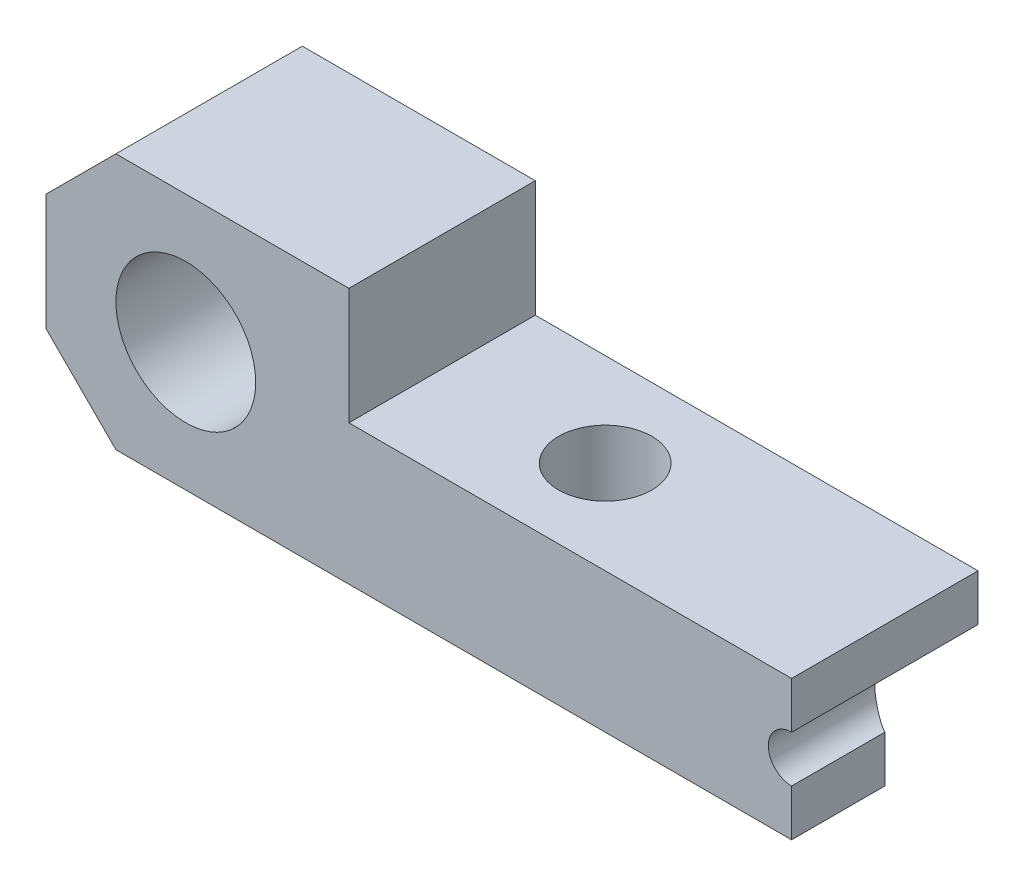
ISO-10303-21;
HEADER;
FILE_DESCRIPTION(('STEP AP214'),'2;1');
FILE_NAME('part.step','',(''),(''),'','','');
FILE_SCHEMA(('AUTOMOTIVE_DESIGN { 1 0 10303 214 1 1 1 1 }'));
ENDSEC;
DATA;
#1=APPLICATION_CONTEXT('core data for automotive mechanical design processes');
#2=APPLICATION_PROTOCOL_DEFINITION('international standard','automotive_design',2000,#1);
#3=PRODUCT_CONTEXT('',#1,'mechanical');
#4=PRODUCT('Part','Part','',(#3));
#5=PRODUCT_RELATED_PRODUCT_CATEGORY('part','',(#4));
#6=PRODUCT_DEFINITION_FORMATION('','',#4);
#7=PRODUCT_DEFINITION_CONTEXT('part definition',#1,'design');
#8=PRODUCT_DEFINITION('design','',#6,#7);
#9=PRODUCT_DEFINITION_SHAPE('','',#8);
#10=(LENGTH_UNIT() NAMED_UNIT(*) SI_UNIT(.MILLI.,.METRE.));
#11=(NAMED_UNIT(*) PLANE_ANGLE_UNIT() SI_UNIT($,.RADIAN.));
#12=(NAMED_UNIT(*) SI_UNIT($,.STERADIAN.) SOLID_ANGLE_UNIT());
#13=UNCERTAINTY_MEASURE_WITH_UNIT(LENGTH_MEASURE(1.E-05),#10,'distance_accuracy_value','');
#14=(GEOMETRIC_REPRESENTATION_CONTEXT(3) GLOBAL_UNCERTAINTY_ASSIGNED_CONTEXT((#13)) GLOBAL_UNIT_ASSIGNED_CONTEXT((#10,
#11,#12)) REPRESENTATION_CONTEXT('',''));
#15=CARTESIAN_POINT('',(0.,0.,0.));
#16=DIRECTION('',(0.,0.,1.));
#17=DIRECTION('',(1.,0.,0.));
#18=AXIS2_PLACEMENT_3D('',#15,#16,#17);
#19=CARTESIAN_POINT('',(32.,0.,8.));
#20=DIRECTION('',(-1.,0.,0.));
#21=DIRECTION('',(0.,0.,1.));
#22=AXIS2_PLACEMENT_3D('',#19,#20,#21);
#23=PLANE('',#22);
#24=DIRECTION('',(0.,0.,-1.));
#25=VECTOR('',#24,1.);
#26=CARTESIAN_POINT('',(32.,0.,8.));
#27=LINE('',#26,#25);
#28=CARTESIAN_POINT('',(32.,0.,8.));
#29=VERTEX_POINT('',#28);
#30=CARTESIAN_POINT('',(32.,0.,4.));
#31=VERTEX_POINT('',#30);
#32=EDGE_CURVE('E156',#29,#31,#27,.T.);
#33=ORIENTED_EDGE('',*,*,#32,.T.);
#34=DIRECTION('',(0.,-1.,0.));
#35=VECTOR('',#34,1.);
#36=CARTESIAN_POINT('',(32.,4.,4.));
#37=LINE('',#36,#35);
#38=CARTESIAN_POINT('',(32.,2.,4.));
#39=VERTEX_POINT('',#38);
#40=EDGE_CURVE('E141',#39,#31,#37,.T.);
#41=ORIENTED_EDGE('',*,*,#40,.F.);
#42=DIRECTION('',(0.,0.,1.));
#43=VECTOR('',#42,1.);
#44=CARTESIAN_POINT('',(32.,2.,0.));
#45=LINE('',#44,#43);
#46=CARTESIAN_POINT('',(32.,2.,8.));
#47=VERTEX_POINT('',#46);
#48=EDGE_CURVE('E149',#39,#47,#45,.T.);
#49=ORIENTED_EDGE('',*,*,#48,.T.);
#50=DIRECTION('',(0.,1.,0.));
#51=VECTOR('',#50,1.);
#52=CARTESIAN_POINT('',(32.,0.,8.));
#53=LINE('',#52,#51);
#54=EDGE_CURVE('E246',#29,#47,#53,.T.);
#55=ORIENTED_EDGE('',*,*,#54,.F.);
#56=EDGE_LOOP('',(#33,#41,#49,#55));
#57=FACE_BOUND('',#56,.T.);
#58=ADVANCED_FACE('F35',(#57),#23,.F.);
#59=CARTESIAN_POINT('',(0.,6.,8.));
#60=DIRECTION('',(0.,0.,1.));
#61=DIRECTION('',(1.,0.,0.));
#62=AXIS2_PLACEMENT_3D('',#59,#60,#61);
#63=PLANE('',#62);
#64=DIRECTION('',(0.,-1.,0.));
#65=VECTOR('',#64,1.);
#66=CARTESIAN_POINT('',(0.,0.,8.));
#67=LINE('',#66,#65);
#68=CARTESIAN_POINT('',(0.,8.00000000000001,8.));
#69=VERTEX_POINT('',#68);
#70=CARTESIAN_POINT('',(0.,3.00000000000001,8.));
#71=VERTEX_POINT('',#70);
#72=EDGE_CURVE('E188',#69,#71,#67,.T.);
#73=ORIENTED_EDGE('',*,*,#72,.T.);
#74=DIRECTION('',(-0.707106781186547,0.707106781186548,0.));
#75=VECTOR('',#74,1.);
#76=CARTESIAN_POINT('',(-1.5,4.50000000000001,8.));
#77=LINE('',#76,#75);
#78=CARTESIAN_POINT('',(3.,0.,8.));
#79=VERTEX_POINT('',#78);
#80=EDGE_CURVE('E43',#71,#79,#77,.F.);
#81=ORIENTED_EDGE('',*,*,#80,.T.);
#82=DIRECTION('',(1.,0.,0.));
#83=VECTOR('',#82,1.);
#84=CARTESIAN_POINT('',(0.,0.,8.));
#85=LINE('',#84,#83);
#86=EDGE_CURVE('E186',#79,#29,#85,.T.);
#87=ORIENTED_EDGE('',*,*,#86,.T.);
#88=ORIENTED_EDGE('',*,*,#54,.T.);
#89=CARTESIAN_POINT('',(32.,3.,8.));
#90=DIRECTION('',(0.,0.,1.));
#91=DIRECTION('',(1.,0.,0.));
#92=AXIS2_PLACEMENT_3D('',#89,#90,#91);
#93=CIRCLE('',#92,0.999999999999998);
#94=CARTESIAN_POINT('',(32.,4.,8.));
#95=VERTEX_POINT('',#94);
#96=EDGE_CURVE('E252',#95,#47,#93,.T.);
#97=ORIENTED_EDGE('',*,*,#96,.F.);
#98=CARTESIAN_POINT('',(32.,6.,8.));
#99=VERTEX_POINT('',#98);
#100=EDGE_CURVE('E155',#95,#99,#53,.T.);
#101=ORIENTED_EDGE('',*,*,#100,.T.);
#102=DIRECTION('',(-1.,0.,0.));
#103=VECTOR('',#102,1.);
#104=CARTESIAN_POINT('',(32.,6.,8.));
#105=LINE('',#104,#103);
#106=CARTESIAN_POINT('',(13.,6.,8.));
#107=VERTEX_POINT('',#106);
#108=EDGE_CURVE('E236',#99,#107,#105,.T.);
#109=ORIENTED_EDGE('',*,*,#108,.T.);
#110=DIRECTION('',(0.,1.,0.));
#111=VECTOR('',#110,1.);
#112=CARTESIAN_POINT('',(13.,11.,8.));
#113=LINE('',#112,#111);
#114=CARTESIAN_POINT('',(13.,11.,8.));
#115=VERTEX_POINT('',#114);
#116=EDGE_CURVE('E245',#107,#115,#113,.T.);
#117=ORIENTED_EDGE('',*,*,#116,.T.);
#118=DIRECTION('',(-1.,0.,0.));
#119=VECTOR('',#118,1.);
#120=CARTESIAN_POINT('',(0.,11.,8.));
#121=LINE('',#120,#119);
#122=CARTESIAN_POINT('',(3.,11.,8.));
#123=VERTEX_POINT('',#122);
#124=EDGE_CURVE('E214',#115,#123,#121,.T.);
#125=ORIENTED_EDGE('',*,*,#124,.T.);
#126=DIRECTION('',(0.707106781186549,0.707106781186546,0.));
#127=VECTOR('',#126,1.);
#128=CARTESIAN_POINT('',(-1.00000000000001,7.,8.));
#129=LINE('',#128,#127);
#130=EDGE_CURVE('E179',#123,#69,#129,.F.);
#131=ORIENTED_EDGE('',*,*,#130,.T.);
#132=EDGE_LOOP('',(#73,#81,#87,#88,#97,#101,#109,#117,#125,#131));
#133=FACE_BOUND('',#132,.T.);
#134=CARTESIAN_POINT('',(6.,5.5,8.));
#135=DIRECTION('',(0.,0.,1.));
#136=DIRECTION('',(1.,0.,0.));
#137=AXIS2_PLACEMENT_3D('',#134,#135,#136);
#138=CIRCLE('',#137,3.);
#139=CARTESIAN_POINT('',(9.,5.5,8.));
#140=VERTEX_POINT('',#139);
#141=EDGE_CURVE('E206',#140,#140,#138,.T.);
#142=ORIENTED_EDGE('',*,*,#141,.F.);
#143=EDGE_LOOP('',(#142));
#144=FACE_BOUND('',#143,.T.);
#145=ADVANCED_FACE('F183',(#133,#144),#63,.T.);
#146=CARTESIAN_POINT('',(0.,6.,0.));
#147=DIRECTION('',(0.,0.,1.));
#148=DIRECTION('',(1.,0.,0.));
#149=AXIS2_PLACEMENT_3D('',#146,#147,#148);
#150=PLANE('',#149);
#151=DIRECTION('',(1.,0.,0.));
#152=VECTOR('',#151,1.);
#153=CARTESIAN_POINT('',(0.,0.,0.));
#154=LINE('',#153,#152);
#155=CARTESIAN_POINT('',(3.,0.,0.));
#156=VERTEX_POINT('',#155);
#157=CARTESIAN_POINT('',(25.,0.,0.));
#158=VERTEX_POINT('',#157);
#159=EDGE_CURVE('E203',#156,#158,#154,.T.);
#160=ORIENTED_EDGE('',*,*,#159,.F.);
#161=DIRECTION('',(0.707106781186547,-0.707106781186548,0.));
#162=VECTOR('',#161,1.);
#163=CARTESIAN_POINT('',(3.,0.,0.));
#164=LINE('',#163,#162);
#165=CARTESIAN_POINT('',(0.,3.00000000000001,0.));
#166=VERTEX_POINT('',#165);
#167=EDGE_CURVE('E173',#156,#166,#164,.F.);
#168=ORIENTED_EDGE('',*,*,#167,.T.);
#169=DIRECTION('',(0.,-1.,0.));
#170=VECTOR('',#169,1.);
#171=CARTESIAN_POINT('',(0.,0.,0.));
#172=LINE('',#171,#170);
#173=CARTESIAN_POINT('',(0.,8.,0.));
#174=VERTEX_POINT('',#173);
#175=EDGE_CURVE('E202',#174,#166,#172,.T.);
#176=ORIENTED_EDGE('',*,*,#175,.F.);
#177=DIRECTION('',(-0.707106781186549,-0.707106781186546,0.));
#178=VECTOR('',#177,1.);
#179=CARTESIAN_POINT('',(0.,8.00000000000001,0.));
#180=LINE('',#179,#178);
#181=CARTESIAN_POINT('',(3.,11.,0.));
#182=VERTEX_POINT('',#181);
#183=EDGE_CURVE('E171',#174,#182,#180,.F.);
#184=ORIENTED_EDGE('',*,*,#183,.T.);
#185=DIRECTION('',(-1.,0.,0.));
#186=VECTOR('',#185,1.);
#187=CARTESIAN_POINT('',(0.,11.,0.));
#188=LINE('',#187,#186);
#189=CARTESIAN_POINT('',(13.,11.,0.));
#190=VERTEX_POINT('',#189);
#191=EDGE_CURVE('E223',#190,#182,#188,.T.);
#192=ORIENTED_EDGE('',*,*,#191,.F.);
#193=DIRECTION('',(0.,1.,0.));
#194=VECTOR('',#193,1.);
#195=CARTESIAN_POINT('',(13.,11.,0.));
#196=LINE('',#195,#194);
#197=CARTESIAN_POINT('',(13.,6.,0.));
#198=VERTEX_POINT('',#197);
#199=EDGE_CURVE('E221',#198,#190,#196,.T.);
#200=ORIENTED_EDGE('',*,*,#199,.F.);
#201=DIRECTION('',(-1.,0.,0.));
#202=VECTOR('',#201,1.);
#203=CARTESIAN_POINT('',(32.,6.,0.));
#204=LINE('',#203,#202);
#205=CARTESIAN_POINT('',(32.,6.,0.));
#206=VERTEX_POINT('',#205);
#207=EDGE_CURVE('E218',#206,#198,#204,.T.);
#208=ORIENTED_EDGE('',*,*,#207,.F.);
#209=DIRECTION('',(0.,1.,0.));
#210=VECTOR('',#209,1.);
#211=CARTESIAN_POINT('',(32.,0.,0.));
#212=LINE('',#211,#210);
#213=CARTESIAN_POINT('',(32.,4.,0.));
#214=VERTEX_POINT('',#213);
#215=EDGE_CURVE('E208',#214,#206,#212,.T.);
#216=ORIENTED_EDGE('',*,*,#215,.F.);
#217=DIRECTION('',(1.,0.,0.));
#218=VECTOR('',#217,1.);
#219=CARTESIAN_POINT('',(32.,4.,0.));
#220=LINE('',#219,#218);
#221=CARTESIAN_POINT('',(25.,4.,0.));
#222=VERTEX_POINT('',#221);
#223=EDGE_CURVE('E128',#222,#214,#220,.T.);
#224=ORIENTED_EDGE('',*,*,#223,.F.);
#225=DIRECTION('',(0.,-1.,0.));
#226=VECTOR('',#225,1.);
#227=CARTESIAN_POINT('',(25.,4.,0.));
#228=LINE('',#227,#226);
#229=EDGE_CURVE('E140',#222,#158,#228,.T.);
#230=ORIENTED_EDGE('',*,*,#229,.T.);
#231=EDGE_LOOP('',(#160,#168,#176,#184,#192,#200,#208,#216,#224,#230));
#232=FACE_BOUND('',#231,.T.);
#233=CARTESIAN_POINT('',(6.,5.5,0.));
#234=DIRECTION('',(0.,0.,1.));
#235=DIRECTION('',(1.,0.,0.));
#236=AXIS2_PLACEMENT_3D('',#233,#234,#235);
#237=CIRCLE('',#236,3.);
#238=CARTESIAN_POINT('',(9.,5.5,0.));
#239=VERTEX_POINT('',#238);
#240=EDGE_CURVE('E211',#239,#239,#237,.T.);
#241=ORIENTED_EDGE('',*,*,#240,.T.);
#242=EDGE_LOOP('',(#241));
#243=FACE_BOUND('',#242,.T.);
#244=ADVANCED_FACE('F200',(#232,#243),#150,.F.);
#245=CARTESIAN_POINT('',(0.,0.,8.));
#246=DIRECTION('',(1.,0.,0.));
#247=DIRECTION('',(0.,1.,0.));
#248=AXIS2_PLACEMENT_3D('',#245,#246,#247);
#249=PLANE('',#248);
#250=ORIENTED_EDGE('',*,*,#175,.T.);
#251=DIRECTION('',(0.,0.,1.));
#252=VECTOR('',#251,1.);
#253=CARTESIAN_POINT('',(0.,3.00000000000001,8.));
#254=LINE('',#253,#252);
#255=EDGE_CURVE('E56',#166,#71,#254,.T.);
#256=ORIENTED_EDGE('',*,*,#255,.T.);
#257=ORIENTED_EDGE('',*,*,#72,.F.);
#258=DIRECTION('',(0.,0.,-1.));
#259=VECTOR('',#258,1.);
#260=CARTESIAN_POINT('',(0.,8.00000000000001,8.));
#261=LINE('',#260,#259);
#262=EDGE_CURVE('E175',#69,#174,#261,.T.);
#263=ORIENTED_EDGE('',*,*,#262,.T.);
#264=EDGE_LOOP('',(#250,#256,#257,#263));
#265=FACE_BOUND('',#264,.T.);
#266=ADVANCED_FACE('F204',(#265),#249,.F.);
#267=CARTESIAN_POINT('',(0.,0.,8.));
#268=DIRECTION('',(0.,1.,0.));
#269=DIRECTION('',(0.,0.,1.));
#270=AXIS2_PLACEMENT_3D('',#267,#268,#269);
#271=PLANE('',#270);
#272=CARTESIAN_POINT('',(20.,0.,4.));
#273=DIRECTION('',(0.,-1.,0.));
#274=DIRECTION('',(0.,0.,-1.));
#275=AXIS2_PLACEMENT_3D('',#272,#273,#274);
#276=CIRCLE('',#275,2.);
#277=CARTESIAN_POINT('',(20.,0.,2.));
#278=VERTEX_POINT('',#277);
#279=EDGE_CURVE('E168',#278,#278,#276,.T.);
#280=ORIENTED_EDGE('',*,*,#279,.F.);
#281=EDGE_LOOP('',(#280));
#282=FACE_BOUND('',#281,.T.);
#283=ORIENTED_EDGE('',*,*,#86,.F.);
#284=DIRECTION('',(0.,0.,-1.));
#285=VECTOR('',#284,1.);
#286=CARTESIAN_POINT('',(3.,0.,8.));
#287=LINE('',#286,#285);
#288=EDGE_CURVE('E150',#79,#156,#287,.T.);
#289=ORIENTED_EDGE('',*,*,#288,.T.);
#290=ORIENTED_EDGE('',*,*,#159,.T.);
#291=DIRECTION('',(-0.868243142124459,0.,-0.496138938356834));
#292=VECTOR('',#291,1.);
#293=CARTESIAN_POINT('',(25.,0.,0.));
#294=LINE('',#293,#292);
#295=EDGE_CURVE('E167',#31,#158,#294,.T.);
#296=ORIENTED_EDGE('',*,*,#295,.F.);
#297=ORIENTED_EDGE('',*,*,#32,.F.);
#298=EDGE_LOOP('',(#283,#289,#290,#296,#297));
#299=FACE_BOUND('',#298,.T.);
#300=ADVANCED_FACE('F192',(#282,#299),#271,.F.);
#301=ORIENTED_EDGE('',*,*,#100,.F.);
#302=DIRECTION('',(0.,0.,1.));
#303=VECTOR('',#302,1.);
#304=CARTESIAN_POINT('',(32.,4.,0.));
#305=LINE('',#304,#303);
#306=CARTESIAN_POINT('',(32.,4.,4.));
#307=VERTEX_POINT('',#306);
#308=EDGE_CURVE('E147',#95,#307,#305,.F.);
#309=ORIENTED_EDGE('',*,*,#308,.T.);
#310=DIRECTION('',(0.,0.,1.));
#311=VECTOR('',#310,1.);
#312=CARTESIAN_POINT('',(32.,4.,4.));
#313=LINE('',#312,#311);
#314=EDGE_CURVE('E123',#214,#307,#313,.T.);
#315=ORIENTED_EDGE('',*,*,#314,.F.);
#316=ORIENTED_EDGE('',*,*,#215,.T.);
#317=DIRECTION('',(0.,0.,-1.));
#318=VECTOR('',#317,1.);
#319=CARTESIAN_POINT('',(32.,6.,8.));
#320=LINE('',#319,#318);
#321=EDGE_CURVE('E160',#99,#206,#320,.T.);
#322=ORIENTED_EDGE('',*,*,#321,.F.);
#323=EDGE_LOOP('',(#301,#309,#315,#316,#322));
#324=FACE_BOUND('',#323,.T.);
#325=ADVANCED_FACE('F153',(#324),#23,.F.);
#326=CARTESIAN_POINT('',(32.,6.,8.));
#327=DIRECTION('',(0.,-1.,0.));
#328=DIRECTION('',(1.,0.,0.));
#329=AXIS2_PLACEMENT_3D('',#326,#327,#328);
#330=PLANE('',#329);
#331=CARTESIAN_POINT('',(20.,6.,4.));
#332=DIRECTION('',(0.,-1.,0.));
#333=DIRECTION('',(1.,0.,0.));
#334=AXIS2_PLACEMENT_3D('',#331,#332,#333);
#335=CIRCLE('',#334,2.);
#336=CARTESIAN_POINT('',(22.,6.,4.));
#337=VERTEX_POINT('',#336);
#338=EDGE_CURVE('E164',#337,#337,#335,.T.);
#339=ORIENTED_EDGE('',*,*,#338,.T.);
#340=EDGE_LOOP('',(#339));
#341=FACE_BOUND('',#340,.T.);
#342=ORIENTED_EDGE('',*,*,#207,.T.);
#343=DIRECTION('',(0.,0.,-1.));
#344=VECTOR('',#343,1.);
#345=CARTESIAN_POINT('',(13.,6.,8.));
#346=LINE('',#345,#344);
#347=EDGE_CURVE('E228',#107,#198,#346,.T.);
#348=ORIENTED_EDGE('',*,*,#347,.F.);
#349=ORIENTED_EDGE('',*,*,#108,.F.);
#350=ORIENTED_EDGE('',*,*,#321,.T.);
#351=EDGE_LOOP('',(#342,#348,#349,#350));
#352=FACE_BOUND('',#351,.T.);
#353=ADVANCED_FACE('F234',(#341,#352),#330,.F.);
#354=CARTESIAN_POINT('',(13.,11.,8.));
#355=DIRECTION('',(-1.,0.,0.));
#356=DIRECTION('',(0.,-1.,0.));
#357=AXIS2_PLACEMENT_3D('',#354,#355,#356);
#358=PLANE('',#357);
#359=ORIENTED_EDGE('',*,*,#199,.T.);
#360=DIRECTION('',(0.,0.,-1.));
#361=VECTOR('',#360,1.);
#362=CARTESIAN_POINT('',(13.,11.,8.));
#363=LINE('',#362,#361);
#364=EDGE_CURVE('E225',#115,#190,#363,.T.);
#365=ORIENTED_EDGE('',*,*,#364,.F.);
#366=ORIENTED_EDGE('',*,*,#116,.F.);
#367=ORIENTED_EDGE('',*,*,#347,.T.);
#368=EDGE_LOOP('',(#359,#365,#366,#367));
#369=FACE_BOUND('',#368,.T.);
#370=ADVANCED_FACE('F241',(#369),#358,.F.);
#371=CARTESIAN_POINT('',(0.,11.,8.));
#372=DIRECTION('',(0.,-1.,0.));
#373=DIRECTION('',(0.,0.,-1.));
#374=AXIS2_PLACEMENT_3D('',#371,#372,#373);
#375=PLANE('',#374);
#376=ORIENTED_EDGE('',*,*,#191,.T.);
#377=DIRECTION('',(0.,0.,1.));
#378=VECTOR('',#377,1.);
#379=CARTESIAN_POINT('',(3.,11.,8.));
#380=LINE('',#379,#378);
#381=EDGE_CURVE('E11',#182,#123,#380,.T.);
#382=ORIENTED_EDGE('',*,*,#381,.T.);
#383=ORIENTED_EDGE('',*,*,#124,.F.);
#384=ORIENTED_EDGE('',*,*,#364,.T.);
#385=EDGE_LOOP('',(#376,#382,#383,#384));
#386=FACE_BOUND('',#385,.T.);
#387=ADVANCED_FACE('F243',(#386),#375,.F.);
#388=CARTESIAN_POINT('',(6.,5.5,8.));
#389=DIRECTION('',(0.,0.,-1.));
#390=DIRECTION('',(-1.,0.,0.));
#391=AXIS2_PLACEMENT_3D('',#388,#389,#390);
#392=CYLINDRICAL_SURFACE('',#391,3.);
#393=ORIENTED_EDGE('',*,*,#141,.T.);
#394=EDGE_LOOP('',(#393));
#395=FACE_BOUND('',#394,.T.);
#396=ORIENTED_EDGE('',*,*,#240,.F.);
#397=EDGE_LOOP('',(#396));
#398=FACE_BOUND('',#397,.T.);
#399=ADVANCED_FACE('F287',(#395,#398),#392,.F.);
#400=CARTESIAN_POINT('',(32.,3.,0.));
#401=DIRECTION('',(0.,0.,1.));
#402=DIRECTION('',(1.,0.,0.));
#403=AXIS2_PLACEMENT_3D('',#400,#401,#402);
#404=CYLINDRICAL_SURFACE('',#403,0.999999999999998);
#405=ORIENTED_EDGE('',*,*,#48,.F.);
#406=CARTESIAN_POINT('',(32.,3.,4.));
#407=DIRECTION('',(-0.496138938356834,0.,0.868243142124459));
#408=DIRECTION('',(0.868243142124459,0.,0.496138938356834));
#409=AXIS2_PLACEMENT_3D('',#406,#407,#408);
#410=ELLIPSE('',#409,1.15175110689979,0.999999999999998);
#411=EDGE_CURVE('E136',#39,#307,#410,.F.);
#412=ORIENTED_EDGE('',*,*,#411,.T.);
#413=ORIENTED_EDGE('',*,*,#308,.F.);
#414=ORIENTED_EDGE('',*,*,#96,.T.);
#415=EDGE_LOOP('',(#405,#412,#413,#414));
#416=FACE_BOUND('',#415,.T.);
#417=ADVANCED_FACE('F145',(#416),#404,.F.);
#418=CARTESIAN_POINT('',(25.,4.,0.));
#419=DIRECTION('',(-0.496138938356834,0.,0.868243142124459));
#420=DIRECTION('',(0.868243142124459,0.,0.496138938356834));
#421=AXIS2_PLACEMENT_3D('',#418,#419,#420);
#422=PLANE('',#421);
#423=ORIENTED_EDGE('',*,*,#40,.T.);
#424=ORIENTED_EDGE('',*,*,#295,.T.);
#425=ORIENTED_EDGE('',*,*,#229,.F.);
#426=DIRECTION('',(-0.868243142124459,0.,-0.496138938356834));
#427=VECTOR('',#426,1.);
#428=CARTESIAN_POINT('',(25.,4.,0.));
#429=LINE('',#428,#427);
#430=EDGE_CURVE('E126',#307,#222,#429,.T.);
#431=ORIENTED_EDGE('',*,*,#430,.F.);
#432=ORIENTED_EDGE('',*,*,#411,.F.);
#433=EDGE_LOOP('',(#423,#424,#425,#431,#432));
#434=FACE_BOUND('',#433,.T.);
#435=ADVANCED_FACE('F135',(#434),#422,.F.);
#436=CARTESIAN_POINT('',(32.,4.,0.));
#437=DIRECTION('',(0.,-1.,0.));
#438=DIRECTION('',(0.,0.,-1.));
#439=AXIS2_PLACEMENT_3D('',#436,#437,#438);
#440=PLANE('',#439);
#441=ORIENTED_EDGE('',*,*,#223,.T.);
#442=ORIENTED_EDGE('',*,*,#314,.T.);
#443=ORIENTED_EDGE('',*,*,#430,.T.);
#444=EDGE_LOOP('',(#441,#442,#443));
#445=FACE_BOUND('',#444,.T.);
#446=ADVANCED_FACE('F125',(#445),#440,.T.);
#447=CARTESIAN_POINT('',(20.,11.,4.));
#448=DIRECTION('',(0.,-1.,0.));
#449=DIRECTION('',(0.,0.,-1.));
#450=AXIS2_PLACEMENT_3D('',#447,#448,#449);
#451=CYLINDRICAL_SURFACE('',#450,2.);
#452=ORIENTED_EDGE('',*,*,#279,.T.);
#453=EDGE_LOOP('',(#452));
#454=FACE_BOUND('',#453,.T.);
#455=ORIENTED_EDGE('',*,*,#338,.F.);
#456=EDGE_LOOP('',(#455));
#457=FACE_BOUND('',#456,.T.);
#458=ADVANCED_FACE('F262',(#454,#457),#451,.F.);
#459=CARTESIAN_POINT('',(3.,0.,8.));
#460=DIRECTION('',(0.707106781186548,0.707106781186547,0.));
#461=DIRECTION('',(-0.707106781186547,0.707106781186548,0.));
#462=AXIS2_PLACEMENT_3D('',#459,#460,#461);
#463=PLANE('',#462);
#464=ORIENTED_EDGE('',*,*,#80,.F.);
#465=ORIENTED_EDGE('',*,*,#255,.F.);
#466=ORIENTED_EDGE('',*,*,#167,.F.);
#467=ORIENTED_EDGE('',*,*,#288,.F.);
#468=EDGE_LOOP('',(#464,#465,#466,#467));
#469=FACE_BOUND('',#468,.T.);
#470=ADVANCED_FACE('F197',(#469),#463,.F.);
#471=CARTESIAN_POINT('',(0.,8.00000000000001,8.));
#472=DIRECTION('',(0.707106781186546,-0.707106781186549,0.));
#473=DIRECTION('',(0.707106781186549,0.707106781186546,0.));
#474=AXIS2_PLACEMENT_3D('',#471,#472,#473);
#475=PLANE('',#474);
#476=ORIENTED_EDGE('',*,*,#130,.F.);
#477=ORIENTED_EDGE('',*,*,#381,.F.);
#478=ORIENTED_EDGE('',*,*,#183,.F.);
#479=ORIENTED_EDGE('',*,*,#262,.F.);
#480=EDGE_LOOP('',(#476,#477,#478,#479));
#481=FACE_BOUND('',#480,.T.);
#482=ADVANCED_FACE('F37',(#481),#475,.F.);
#483=CLOSED_SHELL('',(#58,#145,#244,#266,#300,#325,#353,#370,#387,#399,#417,#435,#446,#458,#470,#482));
#484=MANIFOLD_SOLID_BREP('B2',#483);
#485=ADVANCED_BREP_SHAPE_REPRESENTATION('',(#18,#484),#14);
#486=SHAPE_DEFINITION_REPRESENTATION(#9,#485);
ENDSEC;
END-ISO-10303-21;
